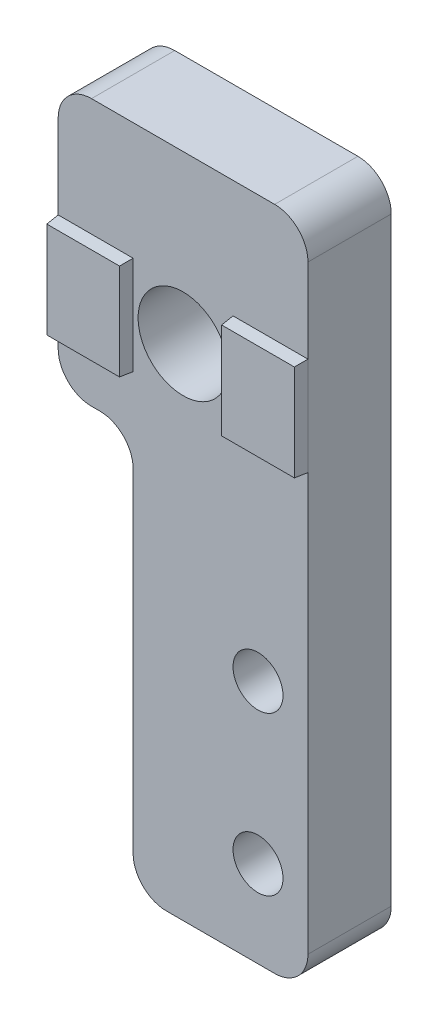
ISO-10303-21;
HEADER;
FILE_DESCRIPTION(('STEP AP214'),'2;1');
FILE_NAME('part.step','',(''),(''),'','','');
FILE_SCHEMA(('AUTOMOTIVE_DESIGN { 1 0 10303 214 1 1 1 1 }'));
ENDSEC;
DATA;
#1=APPLICATION_CONTEXT('core data for automotive mechanical design processes');
#2=APPLICATION_PROTOCOL_DEFINITION('international standard','automotive_design',2000,#1);
#3=PRODUCT_CONTEXT('',#1,'mechanical');
#4=PRODUCT('Part','Part','',(#3));
#5=PRODUCT_RELATED_PRODUCT_CATEGORY('part','',(#4));
#6=PRODUCT_DEFINITION_FORMATION('','',#4);
#7=PRODUCT_DEFINITION_CONTEXT('part definition',#1,'design');
#8=PRODUCT_DEFINITION('design','',#6,#7);
#9=PRODUCT_DEFINITION_SHAPE('','',#8);
#10=(LENGTH_UNIT() NAMED_UNIT(*) SI_UNIT(.MILLI.,.METRE.));
#11=(NAMED_UNIT(*) PLANE_ANGLE_UNIT() SI_UNIT($,.RADIAN.));
#12=(NAMED_UNIT(*) SI_UNIT($,.STERADIAN.) SOLID_ANGLE_UNIT());
#13=UNCERTAINTY_MEASURE_WITH_UNIT(LENGTH_MEASURE(1.E-05),#10,'distance_accuracy_value','');
#14=(GEOMETRIC_REPRESENTATION_CONTEXT(3) GLOBAL_UNCERTAINTY_ASSIGNED_CONTEXT((#13)) GLOBAL_UNIT_ASSIGNED_CONTEXT((#10,
#11,#12)) REPRESENTATION_CONTEXT('',''));
#15=CARTESIAN_POINT('',(0.,0.,0.));
#16=DIRECTION('',(0.,0.,1.));
#17=DIRECTION('',(1.,0.,0.));
#18=AXIS2_PLACEMENT_3D('',#15,#16,#17);
#19=CARTESIAN_POINT('',(13.,-38.,5.));
#20=DIRECTION('',(0.,0.,-1.));
#21=DIRECTION('',(-1.,0.,0.));
#22=AXIS2_PLACEMENT_3D('',#19,#20,#21);
#23=PLANE('',#22);
#24=CARTESIAN_POINT('',(12.,-34.8,5.));
#25=DIRECTION('',(0.,0.,1.));
#26=DIRECTION('',(1.,0.,0.));
#27=AXIS2_PLACEMENT_3D('',#24,#25,#26);
#28=CIRCLE('',#27,1.5);
#29=CARTESIAN_POINT('',(13.5,-34.8,5.));
#30=VERTEX_POINT('',#29);
#31=EDGE_CURVE('E257',#30,#30,#28,.T.);
#32=ORIENTED_EDGE('',*,*,#31,.F.);
#33=EDGE_LOOP('',(#32));
#34=FACE_BOUND('',#33,.T.);
#35=CARTESIAN_POINT('',(7.50000000000001,-10.,5.));
#36=DIRECTION('',(0.,0.,1.));
#37=DIRECTION('',(1.,0.,0.));
#38=AXIS2_PLACEMENT_3D('',#35,#36,#37);
#39=CIRCLE('',#38,2.7);
#40=CARTESIAN_POINT('',(10.2,-10.,5.));
#41=VERTEX_POINT('',#40);
#42=EDGE_CURVE('E263',#41,#41,#39,.T.);
#43=ORIENTED_EDGE('',*,*,#42,.F.);
#44=EDGE_LOOP('',(#43));
#45=FACE_BOUND('',#44,.T.);
#46=CARTESIAN_POINT('',(12.,-25.3,5.));
#47=DIRECTION('',(0.,0.,1.));
#48=DIRECTION('',(1.,0.,0.));
#49=AXIS2_PLACEMENT_3D('',#46,#47,#48);
#50=CIRCLE('',#49,1.5);
#51=CARTESIAN_POINT('',(13.5,-25.3,5.));
#52=VERTEX_POINT('',#51);
#53=EDGE_CURVE('E249',#52,#52,#50,.T.);
#54=ORIENTED_EDGE('',*,*,#53,.F.);
#55=EDGE_LOOP('',(#54));
#56=FACE_BOUND('',#55,.T.);
#57=DIRECTION('',(-1.,0.,0.));
#58=VECTOR('',#57,1.);
#59=CARTESIAN_POINT('',(15.,-7.05,5.));
#60=LINE('',#59,#58);
#61=CARTESIAN_POINT('',(15.,-7.05,5.));
#62=VERTEX_POINT('',#61);
#63=CARTESIAN_POINT('',(10.5,-7.05,5.));
#64=VERTEX_POINT('',#63);
#65=EDGE_CURVE('E180',#62,#64,#60,.T.);
#66=ORIENTED_EDGE('',*,*,#65,.F.);
#67=DIRECTION('',(0.,1.,0.));
#68=VECTOR('',#67,1.);
#69=CARTESIAN_POINT('',(15.,-2.00000000000001,5.));
#70=LINE('',#69,#68);
#71=CARTESIAN_POINT('',(15.,-2.00000000000001,5.));
#72=VERTEX_POINT('',#71);
#73=EDGE_CURVE('E171',#62,#72,#70,.T.);
#74=ORIENTED_EDGE('',*,*,#73,.T.);
#75=CARTESIAN_POINT('',(13.,-1.99999999999999,5.));
#76=DIRECTION('',(0.,0.,1.));
#77=DIRECTION('',(-1.,0.,0.));
#78=AXIS2_PLACEMENT_3D('',#75,#76,#77);
#79=CIRCLE('',#78,2.);
#80=CARTESIAN_POINT('',(13.,0.,5.));
#81=VERTEX_POINT('',#80);
#82=EDGE_CURVE('E272',#72,#81,#79,.T.);
#83=ORIENTED_EDGE('',*,*,#82,.T.);
#84=DIRECTION('',(-1.,0.,0.));
#85=VECTOR('',#84,1.);
#86=CARTESIAN_POINT('',(2.00000000000001,0.,5.));
#87=LINE('',#86,#85);
#88=CARTESIAN_POINT('',(2.00000000000001,0.,5.));
#89=VERTEX_POINT('',#88);
#90=EDGE_CURVE('E274',#81,#89,#87,.T.);
#91=ORIENTED_EDGE('',*,*,#90,.T.);
#92=CARTESIAN_POINT('',(2.,-2.,5.));
#93=DIRECTION('',(0.,0.,1.));
#94=DIRECTION('',(-1.,0.,0.));
#95=AXIS2_PLACEMENT_3D('',#92,#93,#94);
#96=CIRCLE('',#95,2.);
#97=CARTESIAN_POINT('',(0.,-2.00000000000001,5.));
#98=VERTEX_POINT('',#97);
#99=EDGE_CURVE('E276',#89,#98,#96,.T.);
#100=ORIENTED_EDGE('',*,*,#99,.T.);
#101=DIRECTION('',(0.,-1.,0.));
#102=VECTOR('',#101,1.);
#103=CARTESIAN_POINT('',(0.,-2.00000000000001,5.));
#104=LINE('',#103,#102);
#105=CARTESIAN_POINT('',(0.,-7.05,5.));
#106=VERTEX_POINT('',#105);
#107=EDGE_CURVE('E287',#98,#106,#104,.T.);
#108=ORIENTED_EDGE('',*,*,#107,.T.);
#109=DIRECTION('',(-1.,0.,0.));
#110=VECTOR('',#109,1.);
#111=CARTESIAN_POINT('',(0.,-7.05,5.));
#112=LINE('',#111,#110);
#113=CARTESIAN_POINT('',(4.5,-7.04999999999999,5.));
#114=VERTEX_POINT('',#113);
#115=EDGE_CURVE('E219',#114,#106,#112,.T.);
#116=ORIENTED_EDGE('',*,*,#115,.F.);
#117=DIRECTION('',(0.,1.,0.));
#118=VECTOR('',#117,1.);
#119=CARTESIAN_POINT('',(4.5,-7.04999999999999,5.));
#120=LINE('',#119,#118);
#121=CARTESIAN_POINT('',(4.5,-12.95,5.));
#122=VERTEX_POINT('',#121);
#123=EDGE_CURVE('E216',#122,#114,#120,.T.);
#124=ORIENTED_EDGE('',*,*,#123,.F.);
#125=DIRECTION('',(1.,0.,0.));
#126=VECTOR('',#125,1.);
#127=CARTESIAN_POINT('',(0.,-12.95,5.));
#128=LINE('',#127,#126);
#129=CARTESIAN_POINT('',(0.,-12.95,5.));
#130=VERTEX_POINT('',#129);
#131=EDGE_CURVE('E220',#130,#122,#128,.T.);
#132=ORIENTED_EDGE('',*,*,#131,.F.);
#133=CARTESIAN_POINT('',(0.,-14.,5.));
#134=VERTEX_POINT('',#133);
#135=EDGE_CURVE('E278',#130,#134,#104,.T.);
#136=ORIENTED_EDGE('',*,*,#135,.T.);
#137=CARTESIAN_POINT('',(2.,-14.,5.));
#138=DIRECTION('',(0.,0.,1.));
#139=DIRECTION('',(-1.,0.,0.));
#140=AXIS2_PLACEMENT_3D('',#137,#138,#139);
#141=CIRCLE('',#140,2.);
#142=CARTESIAN_POINT('',(2.00000000000002,-16.,5.));
#143=VERTEX_POINT('',#142);
#144=EDGE_CURVE('E281',#134,#143,#141,.T.);
#145=ORIENTED_EDGE('',*,*,#144,.T.);
#146=DIRECTION('',(1.,0.,0.));
#147=VECTOR('',#146,1.);
#148=CARTESIAN_POINT('',(2.00000000000002,-16.,5.));
#149=LINE('',#148,#147);
#150=CARTESIAN_POINT('',(2.49999999999999,-16.,5.));
#151=VERTEX_POINT('',#150);
#152=EDGE_CURVE('E351',#143,#151,#149,.T.);
#153=ORIENTED_EDGE('',*,*,#152,.T.);
#154=CARTESIAN_POINT('',(2.5,-18.,5.));
#155=DIRECTION('',(0.,0.,-1.));
#156=DIRECTION('',(1.,0.,0.));
#157=AXIS2_PLACEMENT_3D('',#154,#155,#156);
#158=CIRCLE('',#157,2.);
#159=CARTESIAN_POINT('',(4.5,-18.,5.));
#160=VERTEX_POINT('',#159);
#161=EDGE_CURVE('E350',#151,#160,#158,.T.);
#162=ORIENTED_EDGE('',*,*,#161,.T.);
#163=DIRECTION('',(0.,-1.,0.));
#164=VECTOR('',#163,1.);
#165=CARTESIAN_POINT('',(4.5,-38.,5.));
#166=LINE('',#165,#164);
#167=CARTESIAN_POINT('',(4.5,-38.,5.));
#168=VERTEX_POINT('',#167);
#169=EDGE_CURVE('E348',#160,#168,#166,.T.);
#170=ORIENTED_EDGE('',*,*,#169,.T.);
#171=CARTESIAN_POINT('',(6.50000000000001,-38.,5.));
#172=DIRECTION('',(0.,0.,1.));
#173=DIRECTION('',(-1.,0.,0.));
#174=AXIS2_PLACEMENT_3D('',#171,#172,#173);
#175=CIRCLE('',#174,2.);
#176=CARTESIAN_POINT('',(6.50000000000001,-40.,5.));
#177=VERTEX_POINT('',#176);
#178=EDGE_CURVE('E346',#168,#177,#175,.T.);
#179=ORIENTED_EDGE('',*,*,#178,.T.);
#180=DIRECTION('',(1.,0.,0.));
#181=VECTOR('',#180,1.);
#182=CARTESIAN_POINT('',(6.50000000000001,-40.,5.));
#183=LINE('',#182,#181);
#184=CARTESIAN_POINT('',(13.,-40.,5.));
#185=VERTEX_POINT('',#184);
#186=EDGE_CURVE('E321',#177,#185,#183,.T.);
#187=ORIENTED_EDGE('',*,*,#186,.T.);
#188=CARTESIAN_POINT('',(13.,-38.,5.));
#189=DIRECTION('',(0.,0.,1.));
#190=DIRECTION('',(-1.,0.,0.));
#191=AXIS2_PLACEMENT_3D('',#188,#189,#190);
#192=CIRCLE('',#191,2.);
#193=CARTESIAN_POINT('',(15.,-38.,5.));
#194=VERTEX_POINT('',#193);
#195=EDGE_CURVE('E178',#185,#194,#192,.T.);
#196=ORIENTED_EDGE('',*,*,#195,.T.);
#197=CARTESIAN_POINT('',(15.,-12.95,5.));
#198=VERTEX_POINT('',#197);
#199=EDGE_CURVE('E177',#194,#198,#70,.T.);
#200=ORIENTED_EDGE('',*,*,#199,.T.);
#201=DIRECTION('',(1.,0.,0.));
#202=VECTOR('',#201,1.);
#203=CARTESIAN_POINT('',(15.,-12.95,5.));
#204=LINE('',#203,#202);
#205=CARTESIAN_POINT('',(10.5,-12.95,5.));
#206=VERTEX_POINT('',#205);
#207=EDGE_CURVE('E55',#206,#198,#204,.T.);
#208=ORIENTED_EDGE('',*,*,#207,.F.);
#209=DIRECTION('',(0.,-1.,0.));
#210=VECTOR('',#209,1.);
#211=CARTESIAN_POINT('',(10.5,-7.05,5.));
#212=LINE('',#211,#210);
#213=EDGE_CURVE('E50',#64,#206,#212,.T.);
#214=ORIENTED_EDGE('',*,*,#213,.F.);
#215=EDGE_LOOP('',(#66,#74,#83,#91,#100,#108,#116,#124,#132,#136,#145,#153,#162,#170,#179,#187,
#196,#200,#208,#214));
#216=FACE_BOUND('',#215,.T.);
#217=ADVANCED_FACE('F33',(#34,#45,#56,#216),#23,.F.);
#218=CARTESIAN_POINT('',(13.,-38.,0.));
#219=DIRECTION('',(0.,0.,-1.));
#220=DIRECTION('',(-1.,0.,0.));
#221=AXIS2_PLACEMENT_3D('',#218,#219,#220);
#222=PLANE('',#221);
#223=CARTESIAN_POINT('',(12.,-34.8,0.));
#224=DIRECTION('',(0.,0.,1.));
#225=DIRECTION('',(1.,0.,0.));
#226=AXIS2_PLACEMENT_3D('',#223,#224,#225);
#227=CIRCLE('',#226,1.5);
#228=CARTESIAN_POINT('',(13.5,-34.8,0.));
#229=VERTEX_POINT('',#228);
#230=EDGE_CURVE('E252',#229,#229,#227,.T.);
#231=ORIENTED_EDGE('',*,*,#230,.T.);
#232=EDGE_LOOP('',(#231));
#233=FACE_BOUND('',#232,.T.);
#234=CARTESIAN_POINT('',(13.,-38.,0.));
#235=DIRECTION('',(0.,0.,1.));
#236=DIRECTION('',(-1.,0.,0.));
#237=AXIS2_PLACEMENT_3D('',#234,#235,#236);
#238=CIRCLE('',#237,2.);
#239=CARTESIAN_POINT('',(13.,-40.,0.));
#240=VERTEX_POINT('',#239);
#241=CARTESIAN_POINT('',(15.,-38.,0.));
#242=VERTEX_POINT('',#241);
#243=EDGE_CURVE('E266',#240,#242,#238,.T.);
#244=ORIENTED_EDGE('',*,*,#243,.F.);
#245=DIRECTION('',(1.,0.,0.));
#246=VECTOR('',#245,1.);
#247=CARTESIAN_POINT('',(6.50000000000001,-40.,0.));
#248=LINE('',#247,#246);
#249=CARTESIAN_POINT('',(6.50000000000001,-40.,0.));
#250=VERTEX_POINT('',#249);
#251=EDGE_CURVE('E270',#250,#240,#248,.T.);
#252=ORIENTED_EDGE('',*,*,#251,.F.);
#253=CARTESIAN_POINT('',(6.50000000000001,-38.,0.));
#254=DIRECTION('',(0.,0.,1.));
#255=DIRECTION('',(-1.,0.,0.));
#256=AXIS2_PLACEMENT_3D('',#253,#254,#255);
#257=CIRCLE('',#256,2.);
#258=CARTESIAN_POINT('',(4.5,-38.,0.));
#259=VERTEX_POINT('',#258);
#260=EDGE_CURVE('E323',#259,#250,#257,.T.);
#261=ORIENTED_EDGE('',*,*,#260,.F.);
#262=DIRECTION('',(0.,-1.,0.));
#263=VECTOR('',#262,1.);
#264=CARTESIAN_POINT('',(4.5,-38.,0.));
#265=LINE('',#264,#263);
#266=CARTESIAN_POINT('',(4.5,-18.,0.));
#267=VERTEX_POINT('',#266);
#268=EDGE_CURVE('E325',#267,#259,#265,.T.);
#269=ORIENTED_EDGE('',*,*,#268,.F.);
#270=CARTESIAN_POINT('',(2.5,-18.,0.));
#271=DIRECTION('',(0.,0.,-1.));
#272=DIRECTION('',(1.,0.,0.));
#273=AXIS2_PLACEMENT_3D('',#270,#271,#272);
#274=CIRCLE('',#273,2.);
#275=CARTESIAN_POINT('',(2.49999999999999,-16.,0.));
#276=VERTEX_POINT('',#275);
#277=EDGE_CURVE('E327',#276,#267,#274,.T.);
#278=ORIENTED_EDGE('',*,*,#277,.F.);
#279=DIRECTION('',(1.,0.,0.));
#280=VECTOR('',#279,1.);
#281=CARTESIAN_POINT('',(2.00000000000002,-16.,0.));
#282=LINE('',#281,#280);
#283=CARTESIAN_POINT('',(2.00000000000002,-16.,0.));
#284=VERTEX_POINT('',#283);
#285=EDGE_CURVE('E329',#284,#276,#282,.T.);
#286=ORIENTED_EDGE('',*,*,#285,.F.);
#287=CARTESIAN_POINT('',(2.,-14.,0.));
#288=DIRECTION('',(0.,0.,1.));
#289=DIRECTION('',(-1.,0.,0.));
#290=AXIS2_PLACEMENT_3D('',#287,#288,#289);
#291=CIRCLE('',#290,2.);
#292=CARTESIAN_POINT('',(0.,-14.,0.));
#293=VERTEX_POINT('',#292);
#294=EDGE_CURVE('E331',#293,#284,#291,.T.);
#295=ORIENTED_EDGE('',*,*,#294,.F.);
#296=DIRECTION('',(0.,-1.,0.));
#297=VECTOR('',#296,1.);
#298=CARTESIAN_POINT('',(0.,-2.00000000000001,0.));
#299=LINE('',#298,#297);
#300=CARTESIAN_POINT('',(0.,-2.00000000000001,0.));
#301=VERTEX_POINT('',#300);
#302=EDGE_CURVE('E333',#301,#293,#299,.T.);
#303=ORIENTED_EDGE('',*,*,#302,.F.);
#304=CARTESIAN_POINT('',(2.,-2.,0.));
#305=DIRECTION('',(0.,0.,1.));
#306=DIRECTION('',(-1.,0.,0.));
#307=AXIS2_PLACEMENT_3D('',#304,#305,#306);
#308=CIRCLE('',#307,2.);
#309=CARTESIAN_POINT('',(2.00000000000001,0.,0.));
#310=VERTEX_POINT('',#309);
#311=EDGE_CURVE('E335',#310,#301,#308,.T.);
#312=ORIENTED_EDGE('',*,*,#311,.F.);
#313=DIRECTION('',(-1.,0.,0.));
#314=VECTOR('',#313,1.);
#315=CARTESIAN_POINT('',(2.00000000000001,0.,0.));
#316=LINE('',#315,#314);
#317=CARTESIAN_POINT('',(13.,0.,0.));
#318=VERTEX_POINT('',#317);
#319=EDGE_CURVE('E337',#318,#310,#316,.T.);
#320=ORIENTED_EDGE('',*,*,#319,.F.);
#321=CARTESIAN_POINT('',(13.,-1.99999999999999,0.));
#322=DIRECTION('',(0.,0.,1.));
#323=DIRECTION('',(-1.,0.,0.));
#324=AXIS2_PLACEMENT_3D('',#321,#322,#323);
#325=CIRCLE('',#324,2.);
#326=CARTESIAN_POINT('',(15.,-2.00000000000001,0.));
#327=VERTEX_POINT('',#326);
#328=EDGE_CURVE('E339',#327,#318,#325,.T.);
#329=ORIENTED_EDGE('',*,*,#328,.F.);
#330=DIRECTION('',(0.,1.,0.));
#331=VECTOR('',#330,1.);
#332=CARTESIAN_POINT('',(15.,-2.00000000000001,0.));
#333=LINE('',#332,#331);
#334=EDGE_CURVE('E341',#242,#327,#333,.T.);
#335=ORIENTED_EDGE('',*,*,#334,.F.);
#336=EDGE_LOOP('',(#244,#252,#261,#269,#278,#286,#295,#303,#312,#320,#329,#335));
#337=FACE_BOUND('',#336,.T.);
#338=CARTESIAN_POINT('',(7.50000000000001,-10.,0.));
#339=DIRECTION('',(0.,0.,1.));
#340=DIRECTION('',(1.,0.,0.));
#341=AXIS2_PLACEMENT_3D('',#338,#339,#340);
#342=CIRCLE('',#341,2.7);
#343=CARTESIAN_POINT('',(10.2,-10.,0.));
#344=VERTEX_POINT('',#343);
#345=EDGE_CURVE('E260',#344,#344,#342,.T.);
#346=ORIENTED_EDGE('',*,*,#345,.T.);
#347=EDGE_LOOP('',(#346));
#348=FACE_BOUND('',#347,.T.);
#349=CARTESIAN_POINT('',(12.,-25.3,0.));
#350=DIRECTION('',(0.,0.,1.));
#351=DIRECTION('',(1.,0.,0.));
#352=AXIS2_PLACEMENT_3D('',#349,#350,#351);
#353=CIRCLE('',#352,1.5);
#354=CARTESIAN_POINT('',(13.5,-25.3,0.));
#355=VERTEX_POINT('',#354);
#356=EDGE_CURVE('E253',#355,#355,#353,.T.);
#357=ORIENTED_EDGE('',*,*,#356,.T.);
#358=EDGE_LOOP('',(#357));
#359=FACE_BOUND('',#358,.T.);
#360=ADVANCED_FACE('F394',(#233,#337,#348,#359),#222,.T.);
#361=CARTESIAN_POINT('',(13.,-38.,5.));
#362=DIRECTION('',(0.,0.,-1.));
#363=DIRECTION('',(-1.,0.,0.));
#364=AXIS2_PLACEMENT_3D('',#361,#362,#363);
#365=CYLINDRICAL_SURFACE('',#364,2.);
#366=ORIENTED_EDGE('',*,*,#243,.T.);
#367=DIRECTION('',(0.,0.,-1.));
#368=VECTOR('',#367,1.);
#369=CARTESIAN_POINT('',(15.,-38.,5.));
#370=LINE('',#369,#368);
#371=EDGE_CURVE('E11',#194,#242,#370,.T.);
#372=ORIENTED_EDGE('',*,*,#371,.F.);
#373=ORIENTED_EDGE('',*,*,#195,.F.);
#374=DIRECTION('',(0.,0.,-1.));
#375=VECTOR('',#374,1.);
#376=CARTESIAN_POINT('',(13.,-40.,5.));
#377=LINE('',#376,#375);
#378=EDGE_CURVE('E318',#185,#240,#377,.T.);
#379=ORIENTED_EDGE('',*,*,#378,.T.);
#380=EDGE_LOOP('',(#366,#372,#373,#379));
#381=FACE_BOUND('',#380,.T.);
#382=ADVANCED_FACE('F35',(#381),#365,.T.);
#383=CARTESIAN_POINT('',(15.,-2.00000000000001,5.));
#384=DIRECTION('',(-1.,0.,0.));
#385=DIRECTION('',(0.,-1.,0.));
#386=AXIS2_PLACEMENT_3D('',#383,#384,#385);
#387=PLANE('',#386);
#388=ORIENTED_EDGE('',*,*,#334,.T.);
#389=DIRECTION('',(0.,0.,-1.));
#390=VECTOR('',#389,1.);
#391=CARTESIAN_POINT('',(15.,-2.00000000000001,5.));
#392=LINE('',#391,#390);
#393=EDGE_CURVE('E42',#72,#327,#392,.T.);
#394=ORIENTED_EDGE('',*,*,#393,.F.);
#395=ORIENTED_EDGE('',*,*,#73,.F.);
#396=DIRECTION('',(0.,1.,0.));
#397=VECTOR('',#396,1.);
#398=CARTESIAN_POINT('',(15.,-7.05,5.));
#399=LINE('',#398,#397);
#400=EDGE_CURVE('E174',#198,#62,#399,.T.);
#401=ORIENTED_EDGE('',*,*,#400,.F.);
#402=ORIENTED_EDGE('',*,*,#199,.F.);
#403=ORIENTED_EDGE('',*,*,#371,.T.);
#404=EDGE_LOOP('',(#388,#394,#395,#401,#402,#403));
#405=FACE_BOUND('',#404,.T.);
#406=ADVANCED_FACE('F172',(#405),#387,.F.);
#407=CARTESIAN_POINT('',(13.,-1.99999999999999,5.));
#408=DIRECTION('',(0.,0.,-1.));
#409=DIRECTION('',(-1.,0.,0.));
#410=AXIS2_PLACEMENT_3D('',#407,#408,#409);
#411=CYLINDRICAL_SURFACE('',#410,2.);
#412=ORIENTED_EDGE('',*,*,#328,.T.);
#413=DIRECTION('',(0.,0.,-1.));
#414=VECTOR('',#413,1.);
#415=CARTESIAN_POINT('',(13.,0.,5.));
#416=LINE('',#415,#414);
#417=EDGE_CURVE('E291',#81,#318,#416,.T.);
#418=ORIENTED_EDGE('',*,*,#417,.F.);
#419=ORIENTED_EDGE('',*,*,#82,.F.);
#420=ORIENTED_EDGE('',*,*,#393,.T.);
#421=EDGE_LOOP('',(#412,#418,#419,#420));
#422=FACE_BOUND('',#421,.T.);
#423=ADVANCED_FACE('F391',(#422),#411,.T.);
#424=CARTESIAN_POINT('',(2.00000000000001,0.,5.));
#425=DIRECTION('',(0.,-1.,0.));
#426=DIRECTION('',(1.,0.,0.));
#427=AXIS2_PLACEMENT_3D('',#424,#425,#426);
#428=PLANE('',#427);
#429=ORIENTED_EDGE('',*,*,#319,.T.);
#430=DIRECTION('',(0.,0.,-1.));
#431=VECTOR('',#430,1.);
#432=CARTESIAN_POINT('',(2.00000000000001,0.,5.));
#433=LINE('',#432,#431);
#434=EDGE_CURVE('E294',#89,#310,#433,.T.);
#435=ORIENTED_EDGE('',*,*,#434,.F.);
#436=ORIENTED_EDGE('',*,*,#90,.F.);
#437=ORIENTED_EDGE('',*,*,#417,.T.);
#438=EDGE_LOOP('',(#429,#435,#436,#437));
#439=FACE_BOUND('',#438,.T.);
#440=ADVANCED_FACE('F400',(#439),#428,.F.);
#441=CARTESIAN_POINT('',(2.,-2.,5.));
#442=DIRECTION('',(0.,0.,-1.));
#443=DIRECTION('',(-1.,0.,0.));
#444=AXIS2_PLACEMENT_3D('',#441,#442,#443);
#445=CYLINDRICAL_SURFACE('',#444,2.);
#446=ORIENTED_EDGE('',*,*,#311,.T.);
#447=DIRECTION('',(0.,0.,-1.));
#448=VECTOR('',#447,1.);
#449=CARTESIAN_POINT('',(0.,-2.00000000000001,5.));
#450=LINE('',#449,#448);
#451=EDGE_CURVE('E297',#98,#301,#450,.T.);
#452=ORIENTED_EDGE('',*,*,#451,.F.);
#453=ORIENTED_EDGE('',*,*,#99,.F.);
#454=ORIENTED_EDGE('',*,*,#434,.T.);
#455=EDGE_LOOP('',(#446,#452,#453,#454));
#456=FACE_BOUND('',#455,.T.);
#457=ADVANCED_FACE('F404',(#456),#445,.T.);
#458=CARTESIAN_POINT('',(0.,-2.00000000000001,5.));
#459=DIRECTION('',(1.,0.,0.));
#460=DIRECTION('',(0.,1.,0.));
#461=AXIS2_PLACEMENT_3D('',#458,#459,#460);
#462=PLANE('',#461);
#463=ORIENTED_EDGE('',*,*,#302,.T.);
#464=DIRECTION('',(0.,0.,-1.));
#465=VECTOR('',#464,1.);
#466=CARTESIAN_POINT('',(0.,-14.,5.));
#467=LINE('',#466,#465);
#468=EDGE_CURVE('E300',#134,#293,#467,.T.);
#469=ORIENTED_EDGE('',*,*,#468,.F.);
#470=ORIENTED_EDGE('',*,*,#135,.F.);
#471=DIRECTION('',(0.,-1.,0.));
#472=VECTOR('',#471,1.);
#473=CARTESIAN_POINT('',(0.,-7.05,5.));
#474=LINE('',#473,#472);
#475=EDGE_CURVE('E193',#106,#130,#474,.T.);
#476=ORIENTED_EDGE('',*,*,#475,.F.);
#477=ORIENTED_EDGE('',*,*,#107,.F.);
#478=ORIENTED_EDGE('',*,*,#451,.T.);
#479=EDGE_LOOP('',(#463,#469,#470,#476,#477,#478));
#480=FACE_BOUND('',#479,.T.);
#481=ADVANCED_FACE('F429',(#480),#462,.F.);
#482=CARTESIAN_POINT('',(2.,-14.,5.));
#483=DIRECTION('',(0.,0.,-1.));
#484=DIRECTION('',(-1.,0.,0.));
#485=AXIS2_PLACEMENT_3D('',#482,#483,#484);
#486=CYLINDRICAL_SURFACE('',#485,2.);
#487=ORIENTED_EDGE('',*,*,#294,.T.);
#488=DIRECTION('',(0.,0.,-1.));
#489=VECTOR('',#488,1.);
#490=CARTESIAN_POINT('',(2.00000000000002,-16.,5.));
#491=LINE('',#490,#489);
#492=EDGE_CURVE('E303',#143,#284,#491,.T.);
#493=ORIENTED_EDGE('',*,*,#492,.F.);
#494=ORIENTED_EDGE('',*,*,#144,.F.);
#495=ORIENTED_EDGE('',*,*,#468,.T.);
#496=EDGE_LOOP('',(#487,#493,#494,#495));
#497=FACE_BOUND('',#496,.T.);
#498=ADVANCED_FACE('F359',(#497),#486,.T.);
#499=CARTESIAN_POINT('',(2.00000000000002,-16.,5.));
#500=DIRECTION('',(0.,1.,0.));
#501=DIRECTION('',(0.,0.,1.));
#502=AXIS2_PLACEMENT_3D('',#499,#500,#501);
#503=PLANE('',#502);
#504=ORIENTED_EDGE('',*,*,#285,.T.);
#505=DIRECTION('',(0.,0.,-1.));
#506=VECTOR('',#505,1.);
#507=CARTESIAN_POINT('',(2.49999999999999,-16.,5.));
#508=LINE('',#507,#506);
#509=EDGE_CURVE('E306',#151,#276,#508,.T.);
#510=ORIENTED_EDGE('',*,*,#509,.F.);
#511=ORIENTED_EDGE('',*,*,#152,.F.);
#512=ORIENTED_EDGE('',*,*,#492,.T.);
#513=EDGE_LOOP('',(#504,#510,#511,#512));
#514=FACE_BOUND('',#513,.T.);
#515=ADVANCED_FACE('F363',(#514),#503,.F.);
#516=CARTESIAN_POINT('',(2.5,-18.,5.));
#517=DIRECTION('',(0.,0.,-1.));
#518=DIRECTION('',(-1.,0.,0.));
#519=AXIS2_PLACEMENT_3D('',#516,#517,#518);
#520=CYLINDRICAL_SURFACE('',#519,2.);
#521=ORIENTED_EDGE('',*,*,#277,.T.);
#522=DIRECTION('',(0.,0.,-1.));
#523=VECTOR('',#522,1.);
#524=CARTESIAN_POINT('',(4.5,-18.,5.));
#525=LINE('',#524,#523);
#526=EDGE_CURVE('E309',#160,#267,#525,.T.);
#527=ORIENTED_EDGE('',*,*,#526,.F.);
#528=ORIENTED_EDGE('',*,*,#161,.F.);
#529=ORIENTED_EDGE('',*,*,#509,.T.);
#530=EDGE_LOOP('',(#521,#527,#528,#529));
#531=FACE_BOUND('',#530,.T.);
#532=ADVANCED_FACE('F368',(#531),#520,.F.);
#533=CARTESIAN_POINT('',(4.5,-38.,5.));
#534=DIRECTION('',(1.,0.,0.));
#535=DIRECTION('',(0.,1.,0.));
#536=AXIS2_PLACEMENT_3D('',#533,#534,#535);
#537=PLANE('',#536);
#538=ORIENTED_EDGE('',*,*,#268,.T.);
#539=DIRECTION('',(0.,0.,-1.));
#540=VECTOR('',#539,1.);
#541=CARTESIAN_POINT('',(4.5,-38.,5.));
#542=LINE('',#541,#540);
#543=EDGE_CURVE('E312',#168,#259,#542,.T.);
#544=ORIENTED_EDGE('',*,*,#543,.F.);
#545=ORIENTED_EDGE('',*,*,#169,.F.);
#546=ORIENTED_EDGE('',*,*,#526,.T.);
#547=EDGE_LOOP('',(#538,#544,#545,#546));
#548=FACE_BOUND('',#547,.T.);
#549=ADVANCED_FACE('F374',(#548),#537,.F.);
#550=CARTESIAN_POINT('',(6.50000000000001,-38.,5.));
#551=DIRECTION('',(0.,0.,-1.));
#552=DIRECTION('',(-1.,0.,0.));
#553=AXIS2_PLACEMENT_3D('',#550,#551,#552);
#554=CYLINDRICAL_SURFACE('',#553,2.);
#555=ORIENTED_EDGE('',*,*,#260,.T.);
#556=DIRECTION('',(0.,0.,-1.));
#557=VECTOR('',#556,1.);
#558=CARTESIAN_POINT('',(6.50000000000001,-40.,5.));
#559=LINE('',#558,#557);
#560=EDGE_CURVE('E315',#177,#250,#559,.T.);
#561=ORIENTED_EDGE('',*,*,#560,.F.);
#562=ORIENTED_EDGE('',*,*,#178,.F.);
#563=ORIENTED_EDGE('',*,*,#543,.T.);
#564=EDGE_LOOP('',(#555,#561,#562,#563));
#565=FACE_BOUND('',#564,.T.);
#566=ADVANCED_FACE('F378',(#565),#554,.T.);
#567=CARTESIAN_POINT('',(6.50000000000001,-40.,5.));
#568=DIRECTION('',(0.,1.,0.));
#569=DIRECTION('',(0.,0.,1.));
#570=AXIS2_PLACEMENT_3D('',#567,#568,#569);
#571=PLANE('',#570);
#572=ORIENTED_EDGE('',*,*,#251,.T.);
#573=ORIENTED_EDGE('',*,*,#378,.F.);
#574=ORIENTED_EDGE('',*,*,#186,.F.);
#575=ORIENTED_EDGE('',*,*,#560,.T.);
#576=EDGE_LOOP('',(#572,#573,#574,#575));
#577=FACE_BOUND('',#576,.T.);
#578=ADVANCED_FACE('F383',(#577),#571,.F.);
#579=CARTESIAN_POINT('',(7.50000000000001,-10.,5.));
#580=DIRECTION('',(0.,0.,-1.));
#581=DIRECTION('',(-1.,0.,0.));
#582=AXIS2_PLACEMENT_3D('',#579,#580,#581);
#583=CYLINDRICAL_SURFACE('',#582,2.7);
#584=ORIENTED_EDGE('',*,*,#42,.T.);
#585=EDGE_LOOP('',(#584));
#586=FACE_BOUND('',#585,.T.);
#587=ORIENTED_EDGE('',*,*,#345,.F.);
#588=EDGE_LOOP('',(#587));
#589=FACE_BOUND('',#588,.T.);
#590=ADVANCED_FACE('F449',(#586,#589),#583,.F.);
#591=CARTESIAN_POINT('',(12.,-34.8,5.));
#592=DIRECTION('',(0.,0.,-1.));
#593=DIRECTION('',(-1.,0.,0.));
#594=AXIS2_PLACEMENT_3D('',#591,#592,#593);
#595=CYLINDRICAL_SURFACE('',#594,1.5);
#596=ORIENTED_EDGE('',*,*,#31,.T.);
#597=EDGE_LOOP('',(#596));
#598=FACE_BOUND('',#597,.T.);
#599=ORIENTED_EDGE('',*,*,#230,.F.);
#600=EDGE_LOOP('',(#599));
#601=FACE_BOUND('',#600,.T.);
#602=ADVANCED_FACE('F487',(#598,#601),#595,.F.);
#603=CARTESIAN_POINT('',(12.,-25.3,5.));
#604=DIRECTION('',(0.,0.,-1.));
#605=DIRECTION('',(-1.,0.,0.));
#606=AXIS2_PLACEMENT_3D('',#603,#604,#605);
#607=CYLINDRICAL_SURFACE('',#606,1.5);
#608=ORIENTED_EDGE('',*,*,#53,.T.);
#609=EDGE_LOOP('',(#608));
#610=FACE_BOUND('',#609,.T.);
#611=ORIENTED_EDGE('',*,*,#356,.F.);
#612=EDGE_LOOP('',(#611));
#613=FACE_BOUND('',#612,.T.);
#614=ADVANCED_FACE('F494',(#610,#613),#607,.F.);
#615=CARTESIAN_POINT('',(0.,-7.05,5.));
#616=DIRECTION('',(-0.996194698091746,0.,0.0871557427476584));
#617=DIRECTION('',(0.0871557427476584,0.,0.996194698091746));
#618=AXIS2_PLACEMENT_3D('',#615,#616,#617);
#619=PLANE('',#618);
#620=ORIENTED_EDGE('',*,*,#475,.T.);
#621=DIRECTION('',(-0.0868265938642478,-0.0868265938642478,-0.992432509138967));
#622=VECTOR('',#621,1.);
#623=CARTESIAN_POINT('',(0.,-12.95,5.));
#624=LINE('',#623,#622);
#625=CARTESIAN_POINT('',(0.065616497644444,-12.8843835023556,5.75));
#626=VERTEX_POINT('',#625);
#627=EDGE_CURVE('E256',#626,#130,#624,.T.);
#628=ORIENTED_EDGE('',*,*,#627,.F.);
#629=DIRECTION('',(0.,1.,0.));
#630=VECTOR('',#629,1.);
#631=CARTESIAN_POINT('',(0.0656164976444431,-7.05,5.75));
#632=LINE('',#631,#630);
#633=CARTESIAN_POINT('',(0.0656164976444431,-7.11561649764444,5.75));
#634=VERTEX_POINT('',#633);
#635=EDGE_CURVE('E228',#634,#626,#632,.F.);
#636=ORIENTED_EDGE('',*,*,#635,.F.);
#637=DIRECTION('',(-0.0868265938642478,0.0868265938642477,-0.992432509138967));
#638=VECTOR('',#637,1.);
#639=CARTESIAN_POINT('',(0.,-7.05,5.));
#640=LINE('',#639,#638);
#641=EDGE_CURVE('E231',#634,#106,#640,.T.);
#642=ORIENTED_EDGE('',*,*,#641,.T.);
#643=EDGE_LOOP('',(#620,#628,#636,#642));
#644=FACE_BOUND('',#643,.T.);
#645=ADVANCED_FACE('F428',(#644),#619,.T.);
#646=CARTESIAN_POINT('',(0.,-12.95,5.));
#647=DIRECTION('',(0.,-0.996194698091746,0.0871557427476584));
#648=DIRECTION('',(0.,-0.0871557427476584,-0.996194698091746));
#649=AXIS2_PLACEMENT_3D('',#646,#647,#648);
#650=PLANE('',#649);
#651=ORIENTED_EDGE('',*,*,#131,.T.);
#652=DIRECTION('',(0.0868265938642478,-0.0868265938642478,-0.992432509138967));
#653=VECTOR('',#652,1.);
#654=CARTESIAN_POINT('',(4.4555207413278,-12.9055207413278,5.50840025301125));
#655=LINE('',#654,#653);
#656=CARTESIAN_POINT('',(4.43438350235556,-12.8843835023556,5.75));
#657=VERTEX_POINT('',#656);
#658=EDGE_CURVE('E239',#657,#122,#655,.T.);
#659=ORIENTED_EDGE('',*,*,#658,.F.);
#660=DIRECTION('',(-1.,0.,0.));
#661=VECTOR('',#660,1.);
#662=CARTESIAN_POINT('',(0.,-12.8843835023556,5.75));
#663=LINE('',#662,#661);
#664=EDGE_CURVE('E245',#626,#657,#663,.F.);
#665=ORIENTED_EDGE('',*,*,#664,.F.);
#666=ORIENTED_EDGE('',*,*,#627,.T.);
#667=EDGE_LOOP('',(#651,#659,#665,#666));
#668=FACE_BOUND('',#667,.T.);
#669=ADVANCED_FACE('F419',(#668),#650,.T.);
#670=CARTESIAN_POINT('',(4.5,-7.04999999999999,5.));
#671=DIRECTION('',(0.996194698091745,0.,0.0871557427476584));
#672=DIRECTION('',(0.0871557427476584,0.,-0.996194698091746));
#673=AXIS2_PLACEMENT_3D('',#670,#671,#672);
#674=PLANE('',#673);
#675=ORIENTED_EDGE('',*,*,#123,.T.);
#676=DIRECTION('',(0.0868265938642478,0.0868265938642479,-0.992432509138967));
#677=VECTOR('',#676,1.);
#678=CARTESIAN_POINT('',(4.4660751416907,-7.0839248583093,5.38776290483909));
#679=LINE('',#678,#677);
#680=CARTESIAN_POINT('',(4.43438350235556,-7.11561649764444,5.75));
#681=VERTEX_POINT('',#680);
#682=EDGE_CURVE('E223',#681,#114,#679,.T.);
#683=ORIENTED_EDGE('',*,*,#682,.F.);
#684=DIRECTION('',(0.,-1.,0.));
#685=VECTOR('',#684,1.);
#686=CARTESIAN_POINT('',(4.43438350235556,-7.04999999999999,5.75));
#687=LINE('',#686,#685);
#688=EDGE_CURVE('E240',#657,#681,#687,.F.);
#689=ORIENTED_EDGE('',*,*,#688,.F.);
#690=ORIENTED_EDGE('',*,*,#658,.T.);
#691=EDGE_LOOP('',(#675,#683,#689,#690));
#692=FACE_BOUND('',#691,.T.);
#693=ADVANCED_FACE('F413',(#692),#674,.T.);
#694=CARTESIAN_POINT('',(0.,-7.05,5.));
#695=DIRECTION('',(0.,0.996194698091746,0.0871557427476584));
#696=DIRECTION('',(0.,-0.0871557427476584,0.996194698091746));
#697=AXIS2_PLACEMENT_3D('',#694,#695,#696);
#698=PLANE('',#697);
#699=ORIENTED_EDGE('',*,*,#115,.T.);
#700=ORIENTED_EDGE('',*,*,#641,.F.);
#701=DIRECTION('',(1.,0.,0.));
#702=VECTOR('',#701,1.);
#703=CARTESIAN_POINT('',(0.,-7.11561649764444,5.75));
#704=LINE('',#703,#702);
#705=EDGE_CURVE('E233',#681,#634,#704,.F.);
#706=ORIENTED_EDGE('',*,*,#705,.F.);
#707=ORIENTED_EDGE('',*,*,#682,.T.);
#708=EDGE_LOOP('',(#699,#700,#706,#707));
#709=FACE_BOUND('',#708,.T.);
#710=ADVANCED_FACE('F409',(#709),#698,.T.);
#711=CARTESIAN_POINT('',(0.,0.,5.75));
#712=DIRECTION('',(0.,0.,1.));
#713=DIRECTION('',(1.,0.,0.));
#714=AXIS2_PLACEMENT_3D('',#711,#712,#713);
#715=PLANE('',#714);
#716=ORIENTED_EDGE('',*,*,#635,.T.);
#717=ORIENTED_EDGE('',*,*,#664,.T.);
#718=ORIENTED_EDGE('',*,*,#688,.T.);
#719=ORIENTED_EDGE('',*,*,#705,.T.);
#720=EDGE_LOOP('',(#716,#717,#718,#719));
#721=FACE_BOUND('',#720,.T.);
#722=ADVANCED_FACE('F427',(#721),#715,.T.);
#723=CARTESIAN_POINT('',(15.,-7.05,5.));
#724=DIRECTION('',(0.996194698091745,0.,0.0871557427476584));
#725=DIRECTION('',(0.0871557427476584,0.,-0.996194698091746));
#726=AXIS2_PLACEMENT_3D('',#723,#724,#725);
#727=PLANE('',#726);
#728=ORIENTED_EDGE('',*,*,#400,.T.);
#729=DIRECTION('',(0.0868265938642478,0.0868265938642478,-0.992432509138967));
#730=VECTOR('',#729,1.);
#731=CARTESIAN_POINT('',(15.,-7.05,5.));
#732=LINE('',#731,#730);
#733=CARTESIAN_POINT('',(14.9343835023556,-7.11561649764444,5.75));
#734=VERTEX_POINT('',#733);
#735=EDGE_CURVE('E187',#734,#62,#732,.T.);
#736=ORIENTED_EDGE('',*,*,#735,.F.);
#737=DIRECTION('',(0.,-1.,0.));
#738=VECTOR('',#737,1.);
#739=CARTESIAN_POINT('',(14.9343835023556,0.,5.75));
#740=LINE('',#739,#738);
#741=CARTESIAN_POINT('',(14.9343835023556,-12.8843835023556,5.75));
#742=VERTEX_POINT('',#741);
#743=EDGE_CURVE('E203',#742,#734,#740,.F.);
#744=ORIENTED_EDGE('',*,*,#743,.F.);
#745=DIRECTION('',(0.0868265938642478,-0.0868265938642478,-0.992432509138967));
#746=VECTOR('',#745,1.);
#747=CARTESIAN_POINT('',(14.9555207413278,-12.9055207413278,5.50840025301124));
#748=LINE('',#747,#746);
#749=EDGE_CURVE('E199',#742,#198,#748,.T.);
#750=ORIENTED_EDGE('',*,*,#749,.T.);
#751=EDGE_LOOP('',(#728,#736,#744,#750));
#752=FACE_BOUND('',#751,.T.);
#753=ADVANCED_FACE('F197',(#752),#727,.T.);
#754=CARTESIAN_POINT('',(15.,-7.05,5.));
#755=DIRECTION('',(0.,0.996194698091746,0.0871557427476584));
#756=DIRECTION('',(0.,-0.0871557427476584,0.996194698091746));
#757=AXIS2_PLACEMENT_3D('',#754,#755,#756);
#758=PLANE('',#757);
#759=ORIENTED_EDGE('',*,*,#65,.T.);
#760=DIRECTION('',(-0.0868265938642478,0.0868265938642478,-0.992432509138967));
#761=VECTOR('',#760,1.);
#762=CARTESIAN_POINT('',(10.5,-7.05,5.));
#763=LINE('',#762,#761);
#764=CARTESIAN_POINT('',(10.5656164976445,-7.11561649764444,5.75));
#765=VERTEX_POINT('',#764);
#766=EDGE_CURVE('E194',#765,#64,#763,.T.);
#767=ORIENTED_EDGE('',*,*,#766,.F.);
#768=DIRECTION('',(1.,0.,0.));
#769=VECTOR('',#768,1.);
#770=CARTESIAN_POINT('',(0.,-7.11561649764444,5.75));
#771=LINE('',#770,#769);
#772=EDGE_CURVE('E189',#734,#765,#771,.F.);
#773=ORIENTED_EDGE('',*,*,#772,.F.);
#774=ORIENTED_EDGE('',*,*,#735,.T.);
#775=EDGE_LOOP('',(#759,#767,#773,#774));
#776=FACE_BOUND('',#775,.T.);
#777=ADVANCED_FACE('F188',(#776),#758,.T.);
#778=CARTESIAN_POINT('',(10.5,-7.05,5.));
#779=DIRECTION('',(-0.996194698091746,0.,0.0871557427476584));
#780=DIRECTION('',(0.0871557427476584,0.,0.996194698091746));
#781=AXIS2_PLACEMENT_3D('',#778,#779,#780);
#782=PLANE('',#781);
#783=ORIENTED_EDGE('',*,*,#213,.T.);
#784=DIRECTION('',(-0.0868265938642478,-0.0868265938642478,-0.992432509138967));
#785=VECTOR('',#784,1.);
#786=CARTESIAN_POINT('',(10.5339248583093,-12.9160751416907,5.38776290483908));
#787=LINE('',#786,#785);
#788=CARTESIAN_POINT('',(10.5656164976445,-12.8843835023556,5.75));
#789=VERTEX_POINT('',#788);
#790=EDGE_CURVE('E206',#789,#206,#787,.T.);
#791=ORIENTED_EDGE('',*,*,#790,.F.);
#792=DIRECTION('',(0.,1.,0.));
#793=VECTOR('',#792,1.);
#794=CARTESIAN_POINT('',(10.5656164976445,0.,5.75));
#795=LINE('',#794,#793);
#796=EDGE_CURVE('E213',#765,#789,#795,.F.);
#797=ORIENTED_EDGE('',*,*,#796,.F.);
#798=ORIENTED_EDGE('',*,*,#766,.T.);
#799=EDGE_LOOP('',(#783,#791,#797,#798));
#800=FACE_BOUND('',#799,.T.);
#801=ADVANCED_FACE('F544',(#800),#782,.T.);
#802=CARTESIAN_POINT('',(15.,-12.95,5.));
#803=DIRECTION('',(0.,-0.996194698091746,0.0871557427476584));
#804=DIRECTION('',(0.,-0.0871557427476584,-0.996194698091746));
#805=AXIS2_PLACEMENT_3D('',#802,#803,#804);
#806=PLANE('',#805);
#807=ORIENTED_EDGE('',*,*,#207,.T.);
#808=ORIENTED_EDGE('',*,*,#749,.F.);
#809=DIRECTION('',(-1.,0.,0.));
#810=VECTOR('',#809,1.);
#811=CARTESIAN_POINT('',(0.,-12.8843835023556,5.75));
#812=LINE('',#811,#810);
#813=EDGE_CURVE('E207',#789,#742,#812,.F.);
#814=ORIENTED_EDGE('',*,*,#813,.F.);
#815=ORIENTED_EDGE('',*,*,#790,.T.);
#816=EDGE_LOOP('',(#807,#808,#814,#815));
#817=FACE_BOUND('',#816,.T.);
#818=ADVANCED_FACE('F551',(#817),#806,.T.);
#819=CARTESIAN_POINT('',(0.,0.,5.75));
#820=DIRECTION('',(0.,0.,-1.));
#821=DIRECTION('',(-1.,0.,0.));
#822=AXIS2_PLACEMENT_3D('',#819,#820,#821);
#823=PLANE('',#822);
#824=ORIENTED_EDGE('',*,*,#743,.T.);
#825=ORIENTED_EDGE('',*,*,#772,.T.);
#826=ORIENTED_EDGE('',*,*,#796,.T.);
#827=ORIENTED_EDGE('',*,*,#813,.T.);
#828=EDGE_LOOP('',(#824,#825,#826,#827));
#829=FACE_BOUND('',#828,.T.);
#830=ADVANCED_FACE('F559',(#829),#823,.F.);
#831=CLOSED_SHELL('',(#217,#360,#382,#406,#423,#440,#457,#481,#498,#515,#532,#549,#566,#578,
#590,#602,#614,#645,#669,#693,#710,#722,#753,#777,#801,#818,#830));
#832=MANIFOLD_SOLID_BREP('B2',#831);
#833=ADVANCED_BREP_SHAPE_REPRESENTATION('',(#18,#832),#14);
#834=SHAPE_DEFINITION_REPRESENTATION(#9,#833);
ENDSEC;
END-ISO-10303-21;
